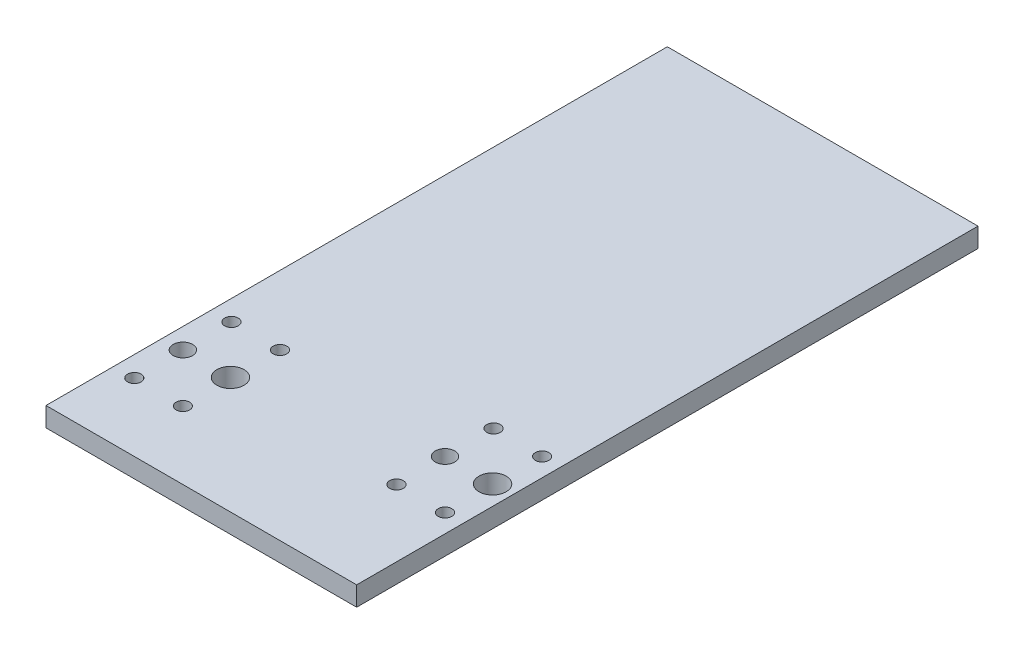
ISO-10303-21;
HEADER;
FILE_DESCRIPTION(('STEP AP214'),'2;1');
FILE_NAME('part.step','',(''),(''),'','','');
FILE_SCHEMA(('AUTOMOTIVE_DESIGN { 1 0 10303 214 1 1 1 1 }'));
ENDSEC;
DATA;
#1=APPLICATION_CONTEXT('core data for automotive mechanical design processes');
#2=APPLICATION_PROTOCOL_DEFINITION('international standard','automotive_design',2000,#1);
#3=PRODUCT_CONTEXT('',#1,'mechanical');
#4=PRODUCT('Part','Part','',(#3));
#5=PRODUCT_RELATED_PRODUCT_CATEGORY('part','',(#4));
#6=PRODUCT_DEFINITION_FORMATION('','',#4);
#7=PRODUCT_DEFINITION_CONTEXT('part definition',#1,'design');
#8=PRODUCT_DEFINITION('design','',#6,#7);
#9=PRODUCT_DEFINITION_SHAPE('','',#8);
#10=(LENGTH_UNIT() NAMED_UNIT(*) SI_UNIT(.MILLI.,.METRE.));
#11=(NAMED_UNIT(*) PLANE_ANGLE_UNIT() SI_UNIT($,.RADIAN.));
#12=(NAMED_UNIT(*) SI_UNIT($,.STERADIAN.) SOLID_ANGLE_UNIT());
#13=UNCERTAINTY_MEASURE_WITH_UNIT(LENGTH_MEASURE(1.E-05),#10,'distance_accuracy_value','');
#14=(GEOMETRIC_REPRESENTATION_CONTEXT(3) GLOBAL_UNCERTAINTY_ASSIGNED_CONTEXT((#13)) GLOBAL_UNIT_ASSIGNED_CONTEXT((#10,
#11,#12)) REPRESENTATION_CONTEXT('',''));
#15=CARTESIAN_POINT('',(0.,0.,0.));
#16=DIRECTION('',(0.,0.,1.));
#17=DIRECTION('',(1.,0.,0.));
#18=AXIS2_PLACEMENT_3D('',#15,#16,#17);
#19=CARTESIAN_POINT('',(16.,1.,-2.60934615072436));
#20=DIRECTION('',(-1.,0.,0.));
#21=DIRECTION('',(0.,0.,1.));
#22=AXIS2_PLACEMENT_3D('',#19,#20,#21);
#23=PLANE('',#22);
#24=DIRECTION('',(0.,0.,-1.));
#25=VECTOR('',#24,1.);
#26=CARTESIAN_POINT('',(16.,0.,-2.60934615072436));
#27=LINE('',#26,#25);
#28=CARTESIAN_POINT('',(16.,0.,-2.60934615072436));
#29=VERTEX_POINT('',#28);
#30=CARTESIAN_POINT('',(16.,0.,-34.6093461507244));
#31=VERTEX_POINT('',#30);
#32=EDGE_CURVE('E94',#29,#31,#27,.T.);
#33=ORIENTED_EDGE('',*,*,#32,.T.);
#34=DIRECTION('',(0.,-1.,0.));
#35=VECTOR('',#34,1.);
#36=CARTESIAN_POINT('',(16.,1.,-34.6093461507244));
#37=LINE('',#36,#35);
#38=CARTESIAN_POINT('',(16.,1.,-34.6093461507244));
#39=VERTEX_POINT('',#38);
#40=EDGE_CURVE('E11',#39,#31,#37,.T.);
#41=ORIENTED_EDGE('',*,*,#40,.F.);
#42=DIRECTION('',(0.,0.,-1.));
#43=VECTOR('',#42,1.);
#44=CARTESIAN_POINT('',(16.,1.,-2.60934615072436));
#45=LINE('',#44,#43);
#46=CARTESIAN_POINT('',(16.,1.,-2.60934615072436));
#47=VERTEX_POINT('',#46);
#48=EDGE_CURVE('E82',#47,#39,#45,.T.);
#49=ORIENTED_EDGE('',*,*,#48,.F.);
#50=DIRECTION('',(0.,-1.,0.));
#51=VECTOR('',#50,1.);
#52=CARTESIAN_POINT('',(16.,1.,-2.60934615072436));
#53=LINE('',#52,#51);
#54=EDGE_CURVE('E90',#47,#29,#53,.T.);
#55=ORIENTED_EDGE('',*,*,#54,.T.);
#56=EDGE_LOOP('',(#33,#41,#49,#55));
#57=FACE_BOUND('',#56,.T.);
#58=ADVANCED_FACE('F31',(#57),#23,.F.);
#59=CARTESIAN_POINT('',(0.,1.,-34.6093461507244));
#60=DIRECTION('',(0.,0.,1.));
#61=DIRECTION('',(1.,0.,0.));
#62=AXIS2_PLACEMENT_3D('',#59,#60,#61);
#63=PLANE('',#62);
#64=DIRECTION('',(-1.,0.,0.));
#65=VECTOR('',#64,1.);
#66=CARTESIAN_POINT('',(0.,0.,-34.6093461507244));
#67=LINE('',#66,#65);
#68=CARTESIAN_POINT('',(0.,0.,-34.6093461507244));
#69=VERTEX_POINT('',#68);
#70=EDGE_CURVE('E86',#31,#69,#67,.T.);
#71=ORIENTED_EDGE('',*,*,#70,.T.);
#72=DIRECTION('',(0.,-1.,0.));
#73=VECTOR('',#72,1.);
#74=CARTESIAN_POINT('',(0.,1.,-34.6093461507244));
#75=LINE('',#74,#73);
#76=CARTESIAN_POINT('',(0.,1.,-34.6093461507244));
#77=VERTEX_POINT('',#76);
#78=EDGE_CURVE('E39',#77,#69,#75,.T.);
#79=ORIENTED_EDGE('',*,*,#78,.F.);
#80=DIRECTION('',(-1.,0.,0.));
#81=VECTOR('',#80,1.);
#82=CARTESIAN_POINT('',(0.,1.,-34.6093461507244));
#83=LINE('',#82,#81);
#84=EDGE_CURVE('E77',#39,#77,#83,.T.);
#85=ORIENTED_EDGE('',*,*,#84,.F.);
#86=ORIENTED_EDGE('',*,*,#40,.T.);
#87=EDGE_LOOP('',(#71,#79,#85,#86));
#88=FACE_BOUND('',#87,.T.);
#89=ADVANCED_FACE('F85',(#88),#63,.F.);
#90=CARTESIAN_POINT('',(0.,1.,-2.60934615072436));
#91=DIRECTION('',(1.,0.,0.));
#92=DIRECTION('',(0.,0.,-1.));
#93=AXIS2_PLACEMENT_3D('',#90,#91,#92);
#94=PLANE('',#93);
#95=DIRECTION('',(0.,0.,1.));
#96=VECTOR('',#95,1.);
#97=CARTESIAN_POINT('',(0.,0.,-2.60934615072436));
#98=LINE('',#97,#96);
#99=CARTESIAN_POINT('',(0.,0.,-2.60934615072436));
#100=VERTEX_POINT('',#99);
#101=EDGE_CURVE('E64',#69,#100,#98,.T.);
#102=ORIENTED_EDGE('',*,*,#101,.T.);
#103=DIRECTION('',(0.,-1.,0.));
#104=VECTOR('',#103,1.);
#105=CARTESIAN_POINT('',(0.,1.,-2.60934615072436));
#106=LINE('',#105,#104);
#107=CARTESIAN_POINT('',(0.,1.,-2.60934615072436));
#108=VERTEX_POINT('',#107);
#109=EDGE_CURVE('E87',#108,#100,#106,.T.);
#110=ORIENTED_EDGE('',*,*,#109,.F.);
#111=DIRECTION('',(0.,0.,1.));
#112=VECTOR('',#111,1.);
#113=CARTESIAN_POINT('',(0.,1.,-2.60934615072436));
#114=LINE('',#113,#112);
#115=EDGE_CURVE('E80',#77,#108,#114,.T.);
#116=ORIENTED_EDGE('',*,*,#115,.F.);
#117=ORIENTED_EDGE('',*,*,#78,.T.);
#118=EDGE_LOOP('',(#102,#110,#116,#117));
#119=FACE_BOUND('',#118,.T.);
#120=ADVANCED_FACE('F88',(#119),#94,.F.);
#121=CARTESIAN_POINT('',(0.,1.,-2.60934615072436));
#122=DIRECTION('',(0.,0.,-1.));
#123=DIRECTION('',(-1.,0.,0.));
#124=AXIS2_PLACEMENT_3D('',#121,#122,#123);
#125=PLANE('',#124);
#126=DIRECTION('',(1.,0.,0.));
#127=VECTOR('',#126,1.);
#128=CARTESIAN_POINT('',(0.,0.,-2.60934615072436));
#129=LINE('',#128,#127);
#130=EDGE_CURVE('E70',#100,#29,#129,.T.);
#131=ORIENTED_EDGE('',*,*,#130,.T.);
#132=ORIENTED_EDGE('',*,*,#54,.F.);
#133=DIRECTION('',(1.,0.,0.));
#134=VECTOR('',#133,1.);
#135=CARTESIAN_POINT('',(0.,1.,-2.60934615072436));
#136=LINE('',#135,#134);
#137=EDGE_CURVE('E47',#108,#47,#136,.T.);
#138=ORIENTED_EDGE('',*,*,#137,.F.);
#139=ORIENTED_EDGE('',*,*,#109,.T.);
#140=EDGE_LOOP('',(#131,#132,#138,#139));
#141=FACE_BOUND('',#140,.T.);
#142=ADVANCED_FACE('F102',(#141),#125,.F.);
#143=CARTESIAN_POINT('',(16.,1.,-34.6093461507244));
#144=DIRECTION('',(0.,-1.,0.));
#145=DIRECTION('',(0.,0.,-1.));
#146=AXIS2_PLACEMENT_3D('',#143,#144,#145);
#147=PLANE('',#146);
#148=CARTESIAN_POINT('',(3.54999999999999,1.,-6.10934615072436));
#149=DIRECTION('',(0.,1.,0.));
#150=DIRECTION('',(0.,0.,1.));
#151=AXIS2_PLACEMENT_3D('',#148,#149,#150);
#152=CIRCLE('',#151,0.35);
#153=CARTESIAN_POINT('',(3.54999999999999,1.,-5.75934615072436));
#154=VERTEX_POINT('',#153);
#155=EDGE_CURVE('E174',#154,#154,#152,.T.);
#156=ORIENTED_EDGE('',*,*,#155,.F.);
#157=EDGE_LOOP('',(#156));
#158=FACE_BOUND('',#157,.T.);
#159=CARTESIAN_POINT('',(1.04999999999999,1.,-6.10934615072436));
#160=DIRECTION('',(0.,1.,0.));
#161=DIRECTION('',(0.,0.,1.));
#162=AXIS2_PLACEMENT_3D('',#159,#160,#161);
#163=CIRCLE('',#162,0.35);
#164=CARTESIAN_POINT('',(1.04999999999999,1.,-5.75934615072436));
#165=VERTEX_POINT('',#164);
#166=EDGE_CURVE('E168',#165,#165,#163,.T.);
#167=ORIENTED_EDGE('',*,*,#166,.F.);
#168=EDGE_LOOP('',(#167));
#169=FACE_BOUND('',#168,.T.);
#170=CARTESIAN_POINT('',(1.04999999999999,1.,-11.1093461507244));
#171=DIRECTION('',(0.,1.,0.));
#172=DIRECTION('',(0.,0.,1.));
#173=AXIS2_PLACEMENT_3D('',#170,#171,#172);
#174=CIRCLE('',#173,0.35);
#175=CARTESIAN_POINT('',(1.04999999999999,1.,-10.7593461507244));
#176=VERTEX_POINT('',#175);
#177=EDGE_CURVE('E162',#176,#176,#174,.T.);
#178=ORIENTED_EDGE('',*,*,#177,.F.);
#179=EDGE_LOOP('',(#178));
#180=FACE_BOUND('',#179,.T.);
#181=CARTESIAN_POINT('',(3.54999999999999,1.,-11.1093461507244));
#182=DIRECTION('',(0.,1.,0.));
#183=DIRECTION('',(0.,0.,1.));
#184=AXIS2_PLACEMENT_3D('',#181,#182,#183);
#185=CIRCLE('',#184,0.35);
#186=CARTESIAN_POINT('',(3.54999999999999,1.,-10.7593461507244));
#187=VERTEX_POINT('',#186);
#188=EDGE_CURVE('E156',#187,#187,#185,.T.);
#189=ORIENTED_EDGE('',*,*,#188,.F.);
#190=EDGE_LOOP('',(#189));
#191=FACE_BOUND('',#190,.T.);
#192=CARTESIAN_POINT('',(12.55,1.,-8.10934615072436));
#193=DIRECTION('',(0.,1.,0.));
#194=DIRECTION('',(0.,0.,1.));
#195=AXIS2_PLACEMENT_3D('',#192,#193,#194);
#196=CIRCLE('',#195,0.349999999999999);
#197=CARTESIAN_POINT('',(12.55,1.,-7.75934615072436));
#198=VERTEX_POINT('',#197);
#199=EDGE_CURVE('E150',#198,#198,#196,.T.);
#200=ORIENTED_EDGE('',*,*,#199,.F.);
#201=EDGE_LOOP('',(#200));
#202=FACE_BOUND('',#201,.T.);
#203=CARTESIAN_POINT('',(15.05,1.,-8.10934615072436));
#204=DIRECTION('',(0.,1.,0.));
#205=DIRECTION('',(0.,0.,1.));
#206=AXIS2_PLACEMENT_3D('',#203,#204,#205);
#207=CIRCLE('',#206,0.349999999999999);
#208=CARTESIAN_POINT('',(15.05,1.,-7.75934615072436));
#209=VERTEX_POINT('',#208);
#210=EDGE_CURVE('E144',#209,#209,#207,.T.);
#211=ORIENTED_EDGE('',*,*,#210,.F.);
#212=EDGE_LOOP('',(#211));
#213=FACE_BOUND('',#212,.T.);
#214=CARTESIAN_POINT('',(15.05,1.,-13.1093461507244));
#215=DIRECTION('',(0.,1.,0.));
#216=DIRECTION('',(0.,0.,1.));
#217=AXIS2_PLACEMENT_3D('',#214,#215,#216);
#218=CIRCLE('',#217,0.349999999999999);
#219=CARTESIAN_POINT('',(15.05,1.,-12.7593461507244));
#220=VERTEX_POINT('',#219);
#221=EDGE_CURVE('E138',#220,#220,#218,.T.);
#222=ORIENTED_EDGE('',*,*,#221,.F.);
#223=EDGE_LOOP('',(#222));
#224=FACE_BOUND('',#223,.T.);
#225=CARTESIAN_POINT('',(12.55,1.,-13.1093461507244));
#226=DIRECTION('',(0.,1.,0.));
#227=DIRECTION('',(0.,0.,1.));
#228=AXIS2_PLACEMENT_3D('',#225,#226,#227);
#229=CIRCLE('',#228,0.349999999999999);
#230=CARTESIAN_POINT('',(12.55,1.,-12.7593461507244));
#231=VERTEX_POINT('',#230);
#232=EDGE_CURVE('E132',#231,#231,#229,.T.);
#233=ORIENTED_EDGE('',*,*,#232,.F.);
#234=EDGE_LOOP('',(#233));
#235=FACE_BOUND('',#234,.T.);
#236=CARTESIAN_POINT('',(1.04999999999999,1.,-8.60934615072436));
#237=DIRECTION('',(0.,1.,0.));
#238=DIRECTION('',(0.,0.,1.));
#239=AXIS2_PLACEMENT_3D('',#236,#237,#238);
#240=CIRCLE('',#239,0.500000000000001);
#241=CARTESIAN_POINT('',(1.04999999999999,1.,-8.10934615072436));
#242=VERTEX_POINT('',#241);
#243=EDGE_CURVE('E126',#242,#242,#240,.T.);
#244=ORIENTED_EDGE('',*,*,#243,.F.);
#245=EDGE_LOOP('',(#244));
#246=FACE_BOUND('',#245,.T.);
#247=CARTESIAN_POINT('',(3.49999999999999,1.,-8.60934615072436));
#248=DIRECTION('',(0.,1.,0.));
#249=DIRECTION('',(0.,0.,1.));
#250=AXIS2_PLACEMENT_3D('',#247,#248,#249);
#251=CIRCLE('',#250,0.7);
#252=CARTESIAN_POINT('',(3.49999999999999,1.,-7.90934615072436));
#253=VERTEX_POINT('',#252);
#254=EDGE_CURVE('E120',#253,#253,#251,.T.);
#255=ORIENTED_EDGE('',*,*,#254,.F.);
#256=EDGE_LOOP('',(#255));
#257=FACE_BOUND('',#256,.T.);
#258=CARTESIAN_POINT('',(12.55,1.,-10.6093461507244));
#259=DIRECTION('',(0.,1.,0.));
#260=DIRECTION('',(0.,0.,1.));
#261=AXIS2_PLACEMENT_3D('',#258,#259,#260);
#262=CIRCLE('',#261,0.499999999999992);
#263=CARTESIAN_POINT('',(12.55,1.,-10.1093461507244));
#264=VERTEX_POINT('',#263);
#265=EDGE_CURVE('E114',#264,#264,#262,.T.);
#266=ORIENTED_EDGE('',*,*,#265,.F.);
#267=EDGE_LOOP('',(#266));
#268=FACE_BOUND('',#267,.T.);
#269=CARTESIAN_POINT('',(15.,1.,-10.6093461507244));
#270=DIRECTION('',(0.,1.,0.));
#271=DIRECTION('',(0.,0.,1.));
#272=AXIS2_PLACEMENT_3D('',#269,#270,#271);
#273=CIRCLE('',#272,0.699999999999998);
#274=CARTESIAN_POINT('',(15.,1.,-9.90934615072436));
#275=VERTEX_POINT('',#274);
#276=EDGE_CURVE('E108',#275,#275,#273,.T.);
#277=ORIENTED_EDGE('',*,*,#276,.F.);
#278=EDGE_LOOP('',(#277));
#279=FACE_BOUND('',#278,.T.);
#280=ORIENTED_EDGE('',*,*,#48,.T.);
#281=ORIENTED_EDGE('',*,*,#84,.T.);
#282=ORIENTED_EDGE('',*,*,#115,.T.);
#283=ORIENTED_EDGE('',*,*,#137,.T.);
#284=EDGE_LOOP('',(#280,#281,#282,#283));
#285=FACE_BOUND('',#284,.T.);
#286=ADVANCED_FACE('F78',(#158,#169,#180,#191,#202,#213,#224,#235,#246,#257,#268,#279,#285),
#147,.F.);
#287=CARTESIAN_POINT('',(16.,0.,-34.6093461507244));
#288=DIRECTION('',(0.,-1.,0.));
#289=DIRECTION('',(0.,0.,-1.));
#290=AXIS2_PLACEMENT_3D('',#287,#288,#289);
#291=PLANE('',#290);
#292=CARTESIAN_POINT('',(3.54999999999999,0.,-6.10934615072436));
#293=DIRECTION('',(0.,1.,0.));
#294=DIRECTION('',(0.,0.,1.));
#295=AXIS2_PLACEMENT_3D('',#292,#293,#294);
#296=CIRCLE('',#295,0.35);
#297=CARTESIAN_POINT('',(3.54999999999999,0.,-5.75934615072436));
#298=VERTEX_POINT('',#297);
#299=EDGE_CURVE('E171',#298,#298,#296,.T.);
#300=ORIENTED_EDGE('',*,*,#299,.T.);
#301=EDGE_LOOP('',(#300));
#302=FACE_BOUND('',#301,.T.);
#303=CARTESIAN_POINT('',(1.04999999999999,0.,-6.10934615072436));
#304=DIRECTION('',(0.,1.,0.));
#305=DIRECTION('',(0.,0.,1.));
#306=AXIS2_PLACEMENT_3D('',#303,#304,#305);
#307=CIRCLE('',#306,0.35);
#308=CARTESIAN_POINT('',(1.04999999999999,0.,-5.75934615072436));
#309=VERTEX_POINT('',#308);
#310=EDGE_CURVE('E165',#309,#309,#307,.T.);
#311=ORIENTED_EDGE('',*,*,#310,.T.);
#312=EDGE_LOOP('',(#311));
#313=FACE_BOUND('',#312,.T.);
#314=CARTESIAN_POINT('',(1.04999999999999,0.,-11.1093461507244));
#315=DIRECTION('',(0.,1.,0.));
#316=DIRECTION('',(0.,0.,1.));
#317=AXIS2_PLACEMENT_3D('',#314,#315,#316);
#318=CIRCLE('',#317,0.35);
#319=CARTESIAN_POINT('',(1.04999999999999,0.,-10.7593461507244));
#320=VERTEX_POINT('',#319);
#321=EDGE_CURVE('E159',#320,#320,#318,.T.);
#322=ORIENTED_EDGE('',*,*,#321,.T.);
#323=EDGE_LOOP('',(#322));
#324=FACE_BOUND('',#323,.T.);
#325=CARTESIAN_POINT('',(3.54999999999999,0.,-11.1093461507244));
#326=DIRECTION('',(0.,1.,0.));
#327=DIRECTION('',(0.,0.,1.));
#328=AXIS2_PLACEMENT_3D('',#325,#326,#327);
#329=CIRCLE('',#328,0.35);
#330=CARTESIAN_POINT('',(3.54999999999999,0.,-10.7593461507244));
#331=VERTEX_POINT('',#330);
#332=EDGE_CURVE('E153',#331,#331,#329,.T.);
#333=ORIENTED_EDGE('',*,*,#332,.T.);
#334=EDGE_LOOP('',(#333));
#335=FACE_BOUND('',#334,.T.);
#336=CARTESIAN_POINT('',(12.55,0.,-8.10934615072436));
#337=DIRECTION('',(0.,1.,0.));
#338=DIRECTION('',(0.,0.,1.));
#339=AXIS2_PLACEMENT_3D('',#336,#337,#338);
#340=CIRCLE('',#339,0.349999999999999);
#341=CARTESIAN_POINT('',(12.55,0.,-7.75934615072436));
#342=VERTEX_POINT('',#341);
#343=EDGE_CURVE('E147',#342,#342,#340,.T.);
#344=ORIENTED_EDGE('',*,*,#343,.T.);
#345=EDGE_LOOP('',(#344));
#346=FACE_BOUND('',#345,.T.);
#347=CARTESIAN_POINT('',(15.05,0.,-8.10934615072436));
#348=DIRECTION('',(0.,1.,0.));
#349=DIRECTION('',(0.,0.,1.));
#350=AXIS2_PLACEMENT_3D('',#347,#348,#349);
#351=CIRCLE('',#350,0.349999999999999);
#352=CARTESIAN_POINT('',(15.05,0.,-7.75934615072436));
#353=VERTEX_POINT('',#352);
#354=EDGE_CURVE('E141',#353,#353,#351,.T.);
#355=ORIENTED_EDGE('',*,*,#354,.T.);
#356=EDGE_LOOP('',(#355));
#357=FACE_BOUND('',#356,.T.);
#358=CARTESIAN_POINT('',(15.05,0.,-13.1093461507244));
#359=DIRECTION('',(0.,1.,0.));
#360=DIRECTION('',(0.,0.,1.));
#361=AXIS2_PLACEMENT_3D('',#358,#359,#360);
#362=CIRCLE('',#361,0.349999999999999);
#363=CARTESIAN_POINT('',(15.05,0.,-12.7593461507244));
#364=VERTEX_POINT('',#363);
#365=EDGE_CURVE('E135',#364,#364,#362,.T.);
#366=ORIENTED_EDGE('',*,*,#365,.T.);
#367=EDGE_LOOP('',(#366));
#368=FACE_BOUND('',#367,.T.);
#369=CARTESIAN_POINT('',(12.55,0.,-13.1093461507244));
#370=DIRECTION('',(0.,1.,0.));
#371=DIRECTION('',(0.,0.,1.));
#372=AXIS2_PLACEMENT_3D('',#369,#370,#371);
#373=CIRCLE('',#372,0.349999999999999);
#374=CARTESIAN_POINT('',(12.55,0.,-12.7593461507244));
#375=VERTEX_POINT('',#374);
#376=EDGE_CURVE('E129',#375,#375,#373,.T.);
#377=ORIENTED_EDGE('',*,*,#376,.T.);
#378=EDGE_LOOP('',(#377));
#379=FACE_BOUND('',#378,.T.);
#380=CARTESIAN_POINT('',(1.04999999999999,0.,-8.60934615072436));
#381=DIRECTION('',(0.,1.,0.));
#382=DIRECTION('',(0.,0.,1.));
#383=AXIS2_PLACEMENT_3D('',#380,#381,#382);
#384=CIRCLE('',#383,0.500000000000001);
#385=CARTESIAN_POINT('',(1.04999999999999,0.,-8.10934615072436));
#386=VERTEX_POINT('',#385);
#387=EDGE_CURVE('E123',#386,#386,#384,.T.);
#388=ORIENTED_EDGE('',*,*,#387,.T.);
#389=EDGE_LOOP('',(#388));
#390=FACE_BOUND('',#389,.T.);
#391=CARTESIAN_POINT('',(3.49999999999999,0.,-8.60934615072436));
#392=DIRECTION('',(0.,1.,0.));
#393=DIRECTION('',(0.,0.,1.));
#394=AXIS2_PLACEMENT_3D('',#391,#392,#393);
#395=CIRCLE('',#394,0.7);
#396=CARTESIAN_POINT('',(3.49999999999999,0.,-7.90934615072436));
#397=VERTEX_POINT('',#396);
#398=EDGE_CURVE('E117',#397,#397,#395,.T.);
#399=ORIENTED_EDGE('',*,*,#398,.T.);
#400=EDGE_LOOP('',(#399));
#401=FACE_BOUND('',#400,.T.);
#402=CARTESIAN_POINT('',(12.55,0.,-10.6093461507244));
#403=DIRECTION('',(0.,1.,0.));
#404=DIRECTION('',(0.,0.,1.));
#405=AXIS2_PLACEMENT_3D('',#402,#403,#404);
#406=CIRCLE('',#405,0.499999999999992);
#407=CARTESIAN_POINT('',(12.55,0.,-10.1093461507244));
#408=VERTEX_POINT('',#407);
#409=EDGE_CURVE('E111',#408,#408,#406,.T.);
#410=ORIENTED_EDGE('',*,*,#409,.T.);
#411=EDGE_LOOP('',(#410));
#412=FACE_BOUND('',#411,.T.);
#413=CARTESIAN_POINT('',(15.,0.,-10.6093461507244));
#414=DIRECTION('',(0.,1.,0.));
#415=DIRECTION('',(0.,0.,1.));
#416=AXIS2_PLACEMENT_3D('',#413,#414,#415);
#417=CIRCLE('',#416,0.699999999999998);
#418=CARTESIAN_POINT('',(15.,0.,-9.90934615072436));
#419=VERTEX_POINT('',#418);
#420=EDGE_CURVE('E97',#419,#419,#417,.T.);
#421=ORIENTED_EDGE('',*,*,#420,.T.);
#422=EDGE_LOOP('',(#421));
#423=FACE_BOUND('',#422,.T.);
#424=ORIENTED_EDGE('',*,*,#32,.F.);
#425=ORIENTED_EDGE('',*,*,#130,.F.);
#426=ORIENTED_EDGE('',*,*,#101,.F.);
#427=ORIENTED_EDGE('',*,*,#70,.F.);
#428=EDGE_LOOP('',(#424,#425,#426,#427));
#429=FACE_BOUND('',#428,.T.);
#430=ADVANCED_FACE('F105',(#302,#313,#324,#335,#346,#357,#368,#379,#390,#401,#412,#423,#429),
#291,.T.);
#431=CARTESIAN_POINT('',(15.,0.,-10.6093461507244));
#432=DIRECTION('',(0.,1.,0.));
#433=DIRECTION('',(0.,0.,1.));
#434=AXIS2_PLACEMENT_3D('',#431,#432,#433);
#435=CYLINDRICAL_SURFACE('',#434,0.699999999999998);
#436=ORIENTED_EDGE('',*,*,#420,.F.);
#437=EDGE_LOOP('',(#436));
#438=FACE_BOUND('',#437,.T.);
#439=ORIENTED_EDGE('',*,*,#276,.T.);
#440=EDGE_LOOP('',(#439));
#441=FACE_BOUND('',#440,.T.);
#442=ADVANCED_FACE('F214',(#438,#441),#435,.F.);
#443=CARTESIAN_POINT('',(12.55,0.,-10.6093461507244));
#444=DIRECTION('',(0.,1.,0.));
#445=DIRECTION('',(0.,0.,1.));
#446=AXIS2_PLACEMENT_3D('',#443,#444,#445);
#447=CYLINDRICAL_SURFACE('',#446,0.499999999999992);
#448=ORIENTED_EDGE('',*,*,#409,.F.);
#449=EDGE_LOOP('',(#448));
#450=FACE_BOUND('',#449,.T.);
#451=ORIENTED_EDGE('',*,*,#265,.T.);
#452=EDGE_LOOP('',(#451));
#453=FACE_BOUND('',#452,.T.);
#454=ADVANCED_FACE('F216',(#450,#453),#447,.F.);
#455=CARTESIAN_POINT('',(3.49999999999999,0.,-8.60934615072436));
#456=DIRECTION('',(0.,1.,0.));
#457=DIRECTION('',(0.,0.,1.));
#458=AXIS2_PLACEMENT_3D('',#455,#456,#457);
#459=CYLINDRICAL_SURFACE('',#458,0.7);
#460=ORIENTED_EDGE('',*,*,#398,.F.);
#461=EDGE_LOOP('',(#460));
#462=FACE_BOUND('',#461,.T.);
#463=ORIENTED_EDGE('',*,*,#254,.T.);
#464=EDGE_LOOP('',(#463));
#465=FACE_BOUND('',#464,.T.);
#466=ADVANCED_FACE('F223',(#462,#465),#459,.F.);
#467=CARTESIAN_POINT('',(1.04999999999999,0.,-8.60934615072436));
#468=DIRECTION('',(0.,1.,0.));
#469=DIRECTION('',(0.,0.,1.));
#470=AXIS2_PLACEMENT_3D('',#467,#468,#469);
#471=CYLINDRICAL_SURFACE('',#470,0.500000000000001);
#472=ORIENTED_EDGE('',*,*,#387,.F.);
#473=EDGE_LOOP('',(#472));
#474=FACE_BOUND('',#473,.T.);
#475=ORIENTED_EDGE('',*,*,#243,.T.);
#476=EDGE_LOOP('',(#475));
#477=FACE_BOUND('',#476,.T.);
#478=ADVANCED_FACE('F269',(#474,#477),#471,.F.);
#479=CARTESIAN_POINT('',(12.55,0.,-13.1093461507244));
#480=DIRECTION('',(0.,1.,0.));
#481=DIRECTION('',(0.,0.,1.));
#482=AXIS2_PLACEMENT_3D('',#479,#480,#481);
#483=CYLINDRICAL_SURFACE('',#482,0.349999999999999);
#484=ORIENTED_EDGE('',*,*,#376,.F.);
#485=EDGE_LOOP('',(#484));
#486=FACE_BOUND('',#485,.T.);
#487=ORIENTED_EDGE('',*,*,#232,.T.);
#488=EDGE_LOOP('',(#487));
#489=FACE_BOUND('',#488,.T.);
#490=ADVANCED_FACE('F279',(#486,#489),#483,.F.);
#491=CARTESIAN_POINT('',(15.05,0.,-13.1093461507244));
#492=DIRECTION('',(0.,1.,0.));
#493=DIRECTION('',(0.,0.,1.));
#494=AXIS2_PLACEMENT_3D('',#491,#492,#493);
#495=CYLINDRICAL_SURFACE('',#494,0.349999999999999);
#496=ORIENTED_EDGE('',*,*,#365,.F.);
#497=EDGE_LOOP('',(#496));
#498=FACE_BOUND('',#497,.T.);
#499=ORIENTED_EDGE('',*,*,#221,.T.);
#500=EDGE_LOOP('',(#499));
#501=FACE_BOUND('',#500,.T.);
#502=ADVANCED_FACE('F289',(#498,#501),#495,.F.);
#503=CARTESIAN_POINT('',(15.05,0.,-8.10934615072436));
#504=DIRECTION('',(0.,1.,0.));
#505=DIRECTION('',(0.,0.,1.));
#506=AXIS2_PLACEMENT_3D('',#503,#504,#505);
#507=CYLINDRICAL_SURFACE('',#506,0.349999999999999);
#508=ORIENTED_EDGE('',*,*,#354,.F.);
#509=EDGE_LOOP('',(#508));
#510=FACE_BOUND('',#509,.T.);
#511=ORIENTED_EDGE('',*,*,#210,.T.);
#512=EDGE_LOOP('',(#511));
#513=FACE_BOUND('',#512,.T.);
#514=ADVANCED_FACE('F299',(#510,#513),#507,.F.);
#515=CARTESIAN_POINT('',(12.55,0.,-8.10934615072436));
#516=DIRECTION('',(0.,1.,0.));
#517=DIRECTION('',(0.,0.,1.));
#518=AXIS2_PLACEMENT_3D('',#515,#516,#517);
#519=CYLINDRICAL_SURFACE('',#518,0.349999999999999);
#520=ORIENTED_EDGE('',*,*,#343,.F.);
#521=EDGE_LOOP('',(#520));
#522=FACE_BOUND('',#521,.T.);
#523=ORIENTED_EDGE('',*,*,#199,.T.);
#524=EDGE_LOOP('',(#523));
#525=FACE_BOUND('',#524,.T.);
#526=ADVANCED_FACE('F309',(#522,#525),#519,.F.);
#527=CARTESIAN_POINT('',(3.54999999999999,0.,-11.1093461507244));
#528=DIRECTION('',(0.,1.,0.));
#529=DIRECTION('',(0.,0.,1.));
#530=AXIS2_PLACEMENT_3D('',#527,#528,#529);
#531=CYLINDRICAL_SURFACE('',#530,0.35);
#532=ORIENTED_EDGE('',*,*,#332,.F.);
#533=EDGE_LOOP('',(#532));
#534=FACE_BOUND('',#533,.T.);
#535=ORIENTED_EDGE('',*,*,#188,.T.);
#536=EDGE_LOOP('',(#535));
#537=FACE_BOUND('',#536,.T.);
#538=ADVANCED_FACE('F319',(#534,#537),#531,.F.);
#539=CARTESIAN_POINT('',(1.04999999999999,0.,-11.1093461507244));
#540=DIRECTION('',(0.,1.,0.));
#541=DIRECTION('',(0.,0.,1.));
#542=AXIS2_PLACEMENT_3D('',#539,#540,#541);
#543=CYLINDRICAL_SURFACE('',#542,0.35);
#544=ORIENTED_EDGE('',*,*,#321,.F.);
#545=EDGE_LOOP('',(#544));
#546=FACE_BOUND('',#545,.T.);
#547=ORIENTED_EDGE('',*,*,#177,.T.);
#548=EDGE_LOOP('',(#547));
#549=FACE_BOUND('',#548,.T.);
#550=ADVANCED_FACE('F329',(#546,#549),#543,.F.);
#551=CARTESIAN_POINT('',(1.04999999999999,0.,-6.10934615072436));
#552=DIRECTION('',(0.,1.,0.));
#553=DIRECTION('',(0.,0.,1.));
#554=AXIS2_PLACEMENT_3D('',#551,#552,#553);
#555=CYLINDRICAL_SURFACE('',#554,0.35);
#556=ORIENTED_EDGE('',*,*,#310,.F.);
#557=EDGE_LOOP('',(#556));
#558=FACE_BOUND('',#557,.T.);
#559=ORIENTED_EDGE('',*,*,#166,.T.);
#560=EDGE_LOOP('',(#559));
#561=FACE_BOUND('',#560,.T.);
#562=ADVANCED_FACE('F185',(#558,#561),#555,.F.);
#563=CARTESIAN_POINT('',(3.54999999999999,0.,-6.10934615072436));
#564=DIRECTION('',(0.,1.,0.));
#565=DIRECTION('',(0.,0.,1.));
#566=AXIS2_PLACEMENT_3D('',#563,#564,#565);
#567=CYLINDRICAL_SURFACE('',#566,0.35);
#568=ORIENTED_EDGE('',*,*,#299,.F.);
#569=EDGE_LOOP('',(#568));
#570=FACE_BOUND('',#569,.T.);
#571=ORIENTED_EDGE('',*,*,#155,.T.);
#572=EDGE_LOOP('',(#571));
#573=FACE_BOUND('',#572,.T.);
#574=ADVANCED_FACE('F182',(#570,#573),#567,.F.);
#575=CLOSED_SHELL('',(#58,#89,#120,#142,#286,#430,#442,#454,#466,#478,#490,#502,#514,#526,#538,
#550,#562,#574));
#576=MANIFOLD_SOLID_BREP('B2',#575);
#577=ADVANCED_BREP_SHAPE_REPRESENTATION('',(#18,#576),#14);
#578=SHAPE_DEFINITION_REPRESENTATION(#9,#577);
ENDSEC;
END-ISO-10303-21;
